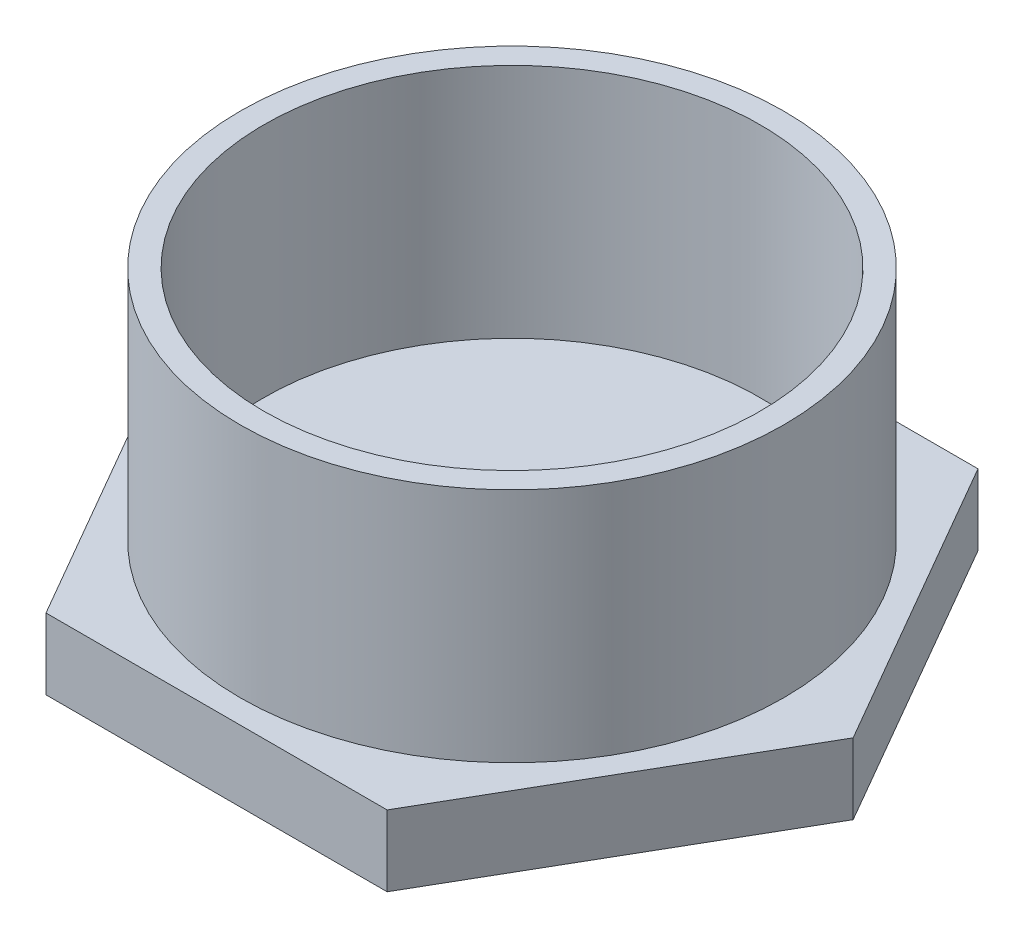
ISO-10303-21;
HEADER;
FILE_DESCRIPTION(('STEP AP214'),'2;1');
FILE_NAME('part.step','',(''),(''),'','','');
FILE_SCHEMA(('AUTOMOTIVE_DESIGN { 1 0 10303 214 1 1 1 1 }'));
ENDSEC;
DATA;
#1=APPLICATION_CONTEXT('core data for automotive mechanical design processes');
#2=APPLICATION_PROTOCOL_DEFINITION('international standard','automotive_design',2000,#1);
#3=PRODUCT_CONTEXT('',#1,'mechanical');
#4=PRODUCT('Part','Part','',(#3));
#5=PRODUCT_RELATED_PRODUCT_CATEGORY('part','',(#4));
#6=PRODUCT_DEFINITION_FORMATION('','',#4);
#7=PRODUCT_DEFINITION_CONTEXT('part definition',#1,'design');
#8=PRODUCT_DEFINITION('design','',#6,#7);
#9=PRODUCT_DEFINITION_SHAPE('','',#8);
#10=(LENGTH_UNIT() NAMED_UNIT(*) SI_UNIT(.MILLI.,.METRE.));
#11=(NAMED_UNIT(*) PLANE_ANGLE_UNIT() SI_UNIT($,.RADIAN.));
#12=(NAMED_UNIT(*) SI_UNIT($,.STERADIAN.) SOLID_ANGLE_UNIT());
#13=UNCERTAINTY_MEASURE_WITH_UNIT(LENGTH_MEASURE(1.E-05),#10,'distance_accuracy_value','');
#14=(GEOMETRIC_REPRESENTATION_CONTEXT(3) GLOBAL_UNCERTAINTY_ASSIGNED_CONTEXT((#13)) GLOBAL_UNIT_ASSIGNED_CONTEXT((#10,
#11,#12)) REPRESENTATION_CONTEXT('',''));
#15=CARTESIAN_POINT('',(0.,0.,0.));
#16=DIRECTION('',(0.,0.,1.));
#17=DIRECTION('',(1.,0.,0.));
#18=AXIS2_PLACEMENT_3D('',#15,#16,#17);
#19=CARTESIAN_POINT('',(-7.21687836487032,3.,12.5));
#20=DIRECTION('',(0.,0.,-1.));
#21=DIRECTION('',(-1.,0.,0.));
#22=AXIS2_PLACEMENT_3D('',#19,#20,#21);
#23=PLANE('',#22);
#24=DIRECTION('',(1.,0.,0.));
#25=VECTOR('',#24,1.);
#26=CARTESIAN_POINT('',(-7.21687836487032,0.,12.5));
#27=LINE('',#26,#25);
#28=CARTESIAN_POINT('',(-7.21687836487032,0.,12.5));
#29=VERTEX_POINT('',#28);
#30=CARTESIAN_POINT('',(7.21687836487032,0.,12.5));
#31=VERTEX_POINT('',#30);
#32=EDGE_CURVE('E119',#29,#31,#27,.T.);
#33=ORIENTED_EDGE('',*,*,#32,.T.);
#34=DIRECTION('',(0.,-1.,0.));
#35=VECTOR('',#34,1.);
#36=CARTESIAN_POINT('',(7.21687836487032,3.,12.5));
#37=LINE('',#36,#35);
#38=CARTESIAN_POINT('',(7.21687836487032,3.,12.5));
#39=VERTEX_POINT('',#38);
#40=EDGE_CURVE('E36',#39,#31,#37,.T.);
#41=ORIENTED_EDGE('',*,*,#40,.F.);
#42=DIRECTION('',(1.,0.,0.));
#43=VECTOR('',#42,1.);
#44=CARTESIAN_POINT('',(-7.21687836487032,3.,12.5));
#45=LINE('',#44,#43);
#46=CARTESIAN_POINT('',(-7.21687836487032,3.,12.5));
#47=VERTEX_POINT('',#46);
#48=EDGE_CURVE('E130',#47,#39,#45,.T.);
#49=ORIENTED_EDGE('',*,*,#48,.F.);
#50=DIRECTION('',(0.,-1.,0.));
#51=VECTOR('',#50,1.);
#52=CARTESIAN_POINT('',(-7.21687836487032,3.,12.5));
#53=LINE('',#52,#51);
#54=EDGE_CURVE('E115',#47,#29,#53,.T.);
#55=ORIENTED_EDGE('',*,*,#54,.T.);
#56=EDGE_LOOP('',(#33,#41,#49,#55));
#57=FACE_BOUND('',#56,.T.);
#58=ADVANCED_FACE('F33',(#57),#23,.F.);
#59=CARTESIAN_POINT('',(7.21687836487032,3.,12.5));
#60=DIRECTION('',(-0.866025403784439,0.,-0.5));
#61=DIRECTION('',(-0.5,0.,0.866025403784439));
#62=AXIS2_PLACEMENT_3D('',#59,#60,#61);
#63=PLANE('',#62);
#64=DIRECTION('',(0.5,0.,-0.866025403784439));
#65=VECTOR('',#64,1.);
#66=CARTESIAN_POINT('',(7.21687836487032,0.,12.5));
#67=LINE('',#66,#65);
#68=CARTESIAN_POINT('',(14.4337567297406,0.,0.));
#69=VERTEX_POINT('',#68);
#70=EDGE_CURVE('E122',#31,#69,#67,.T.);
#71=ORIENTED_EDGE('',*,*,#70,.T.);
#72=DIRECTION('',(0.,-1.,0.));
#73=VECTOR('',#72,1.);
#74=CARTESIAN_POINT('',(14.4337567297406,3.,0.));
#75=LINE('',#74,#73);
#76=CARTESIAN_POINT('',(14.4337567297406,3.,0.));
#77=VERTEX_POINT('',#76);
#78=EDGE_CURVE('E133',#77,#69,#75,.T.);
#79=ORIENTED_EDGE('',*,*,#78,.F.);
#80=DIRECTION('',(0.5,0.,-0.866025403784439));
#81=VECTOR('',#80,1.);
#82=CARTESIAN_POINT('',(7.21687836487032,3.,12.5));
#83=LINE('',#82,#81);
#84=EDGE_CURVE('E88',#39,#77,#83,.T.);
#85=ORIENTED_EDGE('',*,*,#84,.F.);
#86=ORIENTED_EDGE('',*,*,#40,.T.);
#87=EDGE_LOOP('',(#71,#79,#85,#86));
#88=FACE_BOUND('',#87,.T.);
#89=ADVANCED_FACE('F138',(#88),#63,.F.);
#90=CARTESIAN_POINT('',(14.4337567297406,3.,0.));
#91=DIRECTION('',(-0.866025403784439,0.,0.5));
#92=DIRECTION('',(0.5,0.,0.866025403784439));
#93=AXIS2_PLACEMENT_3D('',#90,#91,#92);
#94=PLANE('',#93);
#95=DIRECTION('',(-0.5,0.,-0.866025403784439));
#96=VECTOR('',#95,1.);
#97=CARTESIAN_POINT('',(14.4337567297406,0.,0.));
#98=LINE('',#97,#96);
#99=CARTESIAN_POINT('',(7.21687836487032,0.,-12.5));
#100=VERTEX_POINT('',#99);
#101=EDGE_CURVE('E125',#69,#100,#98,.T.);
#102=ORIENTED_EDGE('',*,*,#101,.T.);
#103=DIRECTION('',(0.,-1.,0.));
#104=VECTOR('',#103,1.);
#105=CARTESIAN_POINT('',(7.21687836487032,3.,-12.5));
#106=LINE('',#105,#104);
#107=CARTESIAN_POINT('',(7.21687836487032,3.,-12.5));
#108=VERTEX_POINT('',#107);
#109=EDGE_CURVE('E110',#108,#100,#106,.T.);
#110=ORIENTED_EDGE('',*,*,#109,.F.);
#111=DIRECTION('',(-0.5,0.,-0.866025403784439));
#112=VECTOR('',#111,1.);
#113=CARTESIAN_POINT('',(14.4337567297406,3.,0.));
#114=LINE('',#113,#112);
#115=EDGE_CURVE('E101',#77,#108,#114,.T.);
#116=ORIENTED_EDGE('',*,*,#115,.F.);
#117=ORIENTED_EDGE('',*,*,#78,.T.);
#118=EDGE_LOOP('',(#102,#110,#116,#117));
#119=FACE_BOUND('',#118,.T.);
#120=ADVANCED_FACE('F144',(#119),#94,.F.);
#121=CARTESIAN_POINT('',(7.21687836487032,3.,-12.5));
#122=DIRECTION('',(0.,0.,1.));
#123=DIRECTION('',(1.,0.,0.));
#124=AXIS2_PLACEMENT_3D('',#121,#122,#123);
#125=PLANE('',#124);
#126=DIRECTION('',(-1.,0.,0.));
#127=VECTOR('',#126,1.);
#128=CARTESIAN_POINT('',(7.21687836487032,0.,-12.5));
#129=LINE('',#128,#127);
#130=CARTESIAN_POINT('',(-7.21687836487033,0.,-12.5));
#131=VERTEX_POINT('',#130);
#132=EDGE_CURVE('E109',#100,#131,#129,.T.);
#133=ORIENTED_EDGE('',*,*,#132,.T.);
#134=DIRECTION('',(0.,-1.,0.));
#135=VECTOR('',#134,1.);
#136=CARTESIAN_POINT('',(-7.21687836487033,3.,-12.5));
#137=LINE('',#136,#135);
#138=CARTESIAN_POINT('',(-7.21687836487033,3.,-12.5));
#139=VERTEX_POINT('',#138);
#140=EDGE_CURVE('E106',#139,#131,#137,.T.);
#141=ORIENTED_EDGE('',*,*,#140,.F.);
#142=DIRECTION('',(-1.,0.,0.));
#143=VECTOR('',#142,1.);
#144=CARTESIAN_POINT('',(7.21687836487032,3.,-12.5));
#145=LINE('',#144,#143);
#146=EDGE_CURVE('E95',#108,#139,#145,.T.);
#147=ORIENTED_EDGE('',*,*,#146,.F.);
#148=ORIENTED_EDGE('',*,*,#109,.T.);
#149=EDGE_LOOP('',(#133,#141,#147,#148));
#150=FACE_BOUND('',#149,.T.);
#151=ADVANCED_FACE('F107',(#150),#125,.F.);
#152=CARTESIAN_POINT('',(-7.21687836487033,3.,-12.5));
#153=DIRECTION('',(0.866025403784439,0.,0.5));
#154=DIRECTION('',(0.5,0.,-0.866025403784439));
#155=AXIS2_PLACEMENT_3D('',#152,#153,#154);
#156=PLANE('',#155);
#157=DIRECTION('',(-0.5,0.,0.866025403784438));
#158=VECTOR('',#157,1.);
#159=CARTESIAN_POINT('',(-7.21687836487033,0.,-12.5));
#160=LINE('',#159,#158);
#161=CARTESIAN_POINT('',(-14.4337567297406,0.,0.));
#162=VERTEX_POINT('',#161);
#163=EDGE_CURVE('E73',#131,#162,#160,.T.);
#164=ORIENTED_EDGE('',*,*,#163,.T.);
#165=DIRECTION('',(0.,-1.,0.));
#166=VECTOR('',#165,1.);
#167=CARTESIAN_POINT('',(-14.4337567297406,3.,0.));
#168=LINE('',#167,#166);
#169=CARTESIAN_POINT('',(-14.4337567297406,3.,0.));
#170=VERTEX_POINT('',#169);
#171=EDGE_CURVE('E111',#170,#162,#168,.T.);
#172=ORIENTED_EDGE('',*,*,#171,.F.);
#173=DIRECTION('',(-0.5,0.,0.866025403784438));
#174=VECTOR('',#173,1.);
#175=CARTESIAN_POINT('',(-7.21687836487033,3.,-12.5));
#176=LINE('',#175,#174);
#177=EDGE_CURVE('E99',#139,#170,#176,.T.);
#178=ORIENTED_EDGE('',*,*,#177,.F.);
#179=ORIENTED_EDGE('',*,*,#140,.T.);
#180=EDGE_LOOP('',(#164,#172,#178,#179));
#181=FACE_BOUND('',#180,.T.);
#182=ADVANCED_FACE('F113',(#181),#156,.F.);
#183=CARTESIAN_POINT('',(-14.4337567297406,3.,0.));
#184=DIRECTION('',(0.866025403784439,0.,-0.5));
#185=DIRECTION('',(-0.5,0.,-0.866025403784439));
#186=AXIS2_PLACEMENT_3D('',#183,#184,#185);
#187=PLANE('',#186);
#188=DIRECTION('',(0.5,0.,0.866025403784439));
#189=VECTOR('',#188,1.);
#190=CARTESIAN_POINT('',(-14.4337567297406,0.,0.));
#191=LINE('',#190,#189);
#192=EDGE_CURVE('E79',#162,#29,#191,.T.);
#193=ORIENTED_EDGE('',*,*,#192,.T.);
#194=ORIENTED_EDGE('',*,*,#54,.F.);
#195=DIRECTION('',(0.5,0.,0.866025403784439));
#196=VECTOR('',#195,1.);
#197=CARTESIAN_POINT('',(-14.4337567297406,3.,0.));
#198=LINE('',#197,#196);
#199=EDGE_CURVE('E50',#170,#47,#198,.T.);
#200=ORIENTED_EDGE('',*,*,#199,.F.);
#201=ORIENTED_EDGE('',*,*,#171,.T.);
#202=EDGE_LOOP('',(#193,#194,#200,#201));
#203=FACE_BOUND('',#202,.T.);
#204=ADVANCED_FACE('F178',(#203),#187,.F.);
#205=CARTESIAN_POINT('',(0.,3.,0.));
#206=DIRECTION('',(0.,1.,0.));
#207=DIRECTION('',(0.,0.,1.));
#208=AXIS2_PLACEMENT_3D('',#205,#206,#207);
#209=PLANE('',#208);
#210=CARTESIAN_POINT('',(0.,3.,0.));
#211=DIRECTION('',(0.,1.,0.));
#212=DIRECTION('',(0.,0.,1.));
#213=AXIS2_PLACEMENT_3D('',#210,#211,#212);
#214=CIRCLE('',#213,11.5);
#215=CARTESIAN_POINT('',(0.,3.,11.5));
#216=VERTEX_POINT('',#215);
#217=EDGE_CURVE('E11',#216,#216,#214,.T.);
#218=ORIENTED_EDGE('',*,*,#217,.F.);
#219=EDGE_LOOP('',(#218));
#220=FACE_BOUND('',#219,.T.);
#221=ORIENTED_EDGE('',*,*,#48,.T.);
#222=ORIENTED_EDGE('',*,*,#84,.T.);
#223=ORIENTED_EDGE('',*,*,#115,.T.);
#224=ORIENTED_EDGE('',*,*,#146,.T.);
#225=ORIENTED_EDGE('',*,*,#177,.T.);
#226=ORIENTED_EDGE('',*,*,#199,.T.);
#227=EDGE_LOOP('',(#221,#222,#223,#224,#225,#226));
#228=FACE_BOUND('',#227,.T.);
#229=ADVANCED_FACE('F97',(#220,#228),#209,.T.);
#230=CARTESIAN_POINT('',(0.,0.,0.));
#231=DIRECTION('',(0.,1.,0.));
#232=DIRECTION('',(0.,0.,1.));
#233=AXIS2_PLACEMENT_3D('',#230,#231,#232);
#234=PLANE('',#233);
#235=ORIENTED_EDGE('',*,*,#32,.F.);
#236=ORIENTED_EDGE('',*,*,#192,.F.);
#237=ORIENTED_EDGE('',*,*,#163,.F.);
#238=ORIENTED_EDGE('',*,*,#132,.F.);
#239=ORIENTED_EDGE('',*,*,#101,.F.);
#240=ORIENTED_EDGE('',*,*,#70,.F.);
#241=EDGE_LOOP('',(#235,#236,#237,#238,#239,#240));
#242=FACE_BOUND('',#241,.T.);
#243=ADVANCED_FACE('F143',(#242),#234,.F.);
#244=CARTESIAN_POINT('',(0.,13.,0.));
#245=DIRECTION('',(0.,-1.,0.));
#246=DIRECTION('',(0.,0.,-1.));
#247=AXIS2_PLACEMENT_3D('',#244,#245,#246);
#248=CYLINDRICAL_SURFACE('',#247,11.5);
#249=CARTESIAN_POINT('',(0.,13.,0.));
#250=DIRECTION('',(0.,1.,0.));
#251=DIRECTION('',(0.,0.,1.));
#252=AXIS2_PLACEMENT_3D('',#249,#250,#251);
#253=CIRCLE('',#252,11.5);
#254=CARTESIAN_POINT('',(0.,13.,11.5));
#255=VERTEX_POINT('',#254);
#256=EDGE_CURVE('E123',#255,#255,#253,.T.);
#257=ORIENTED_EDGE('',*,*,#256,.F.);
#258=EDGE_LOOP('',(#257));
#259=FACE_BOUND('',#258,.T.);
#260=ORIENTED_EDGE('',*,*,#217,.T.);
#261=EDGE_LOOP('',(#260));
#262=FACE_BOUND('',#261,.T.);
#263=ADVANCED_FACE('F168',(#259,#262),#248,.T.);
#264=CARTESIAN_POINT('',(0.,13.,0.));
#265=DIRECTION('',(0.,1.,0.));
#266=DIRECTION('',(0.,0.,1.));
#267=AXIS2_PLACEMENT_3D('',#264,#265,#266);
#268=PLANE('',#267);
#269=CARTESIAN_POINT('',(0.,13.,0.));
#270=DIRECTION('',(0.,1.,0.));
#271=DIRECTION('',(0.,0.,1.));
#272=AXIS2_PLACEMENT_3D('',#269,#270,#271);
#273=CIRCLE('',#272,10.5);
#274=CARTESIAN_POINT('',(0.,13.,10.5));
#275=VERTEX_POINT('',#274);
#276=EDGE_CURVE('E151',#275,#275,#273,.T.);
#277=ORIENTED_EDGE('',*,*,#276,.F.);
#278=EDGE_LOOP('',(#277));
#279=FACE_BOUND('',#278,.T.);
#280=ORIENTED_EDGE('',*,*,#256,.T.);
#281=EDGE_LOOP('',(#280));
#282=FACE_BOUND('',#281,.T.);
#283=ADVANCED_FACE('F162',(#279,#282),#268,.T.);
#284=CARTESIAN_POINT('',(0.,3.,0.));
#285=DIRECTION('',(0.,1.,0.));
#286=DIRECTION('',(0.,0.,1.));
#287=AXIS2_PLACEMENT_3D('',#284,#285,#286);
#288=CYLINDRICAL_SURFACE('',#287,10.5);
#289=CARTESIAN_POINT('',(0.,3.,0.));
#290=DIRECTION('',(0.,1.,0.));
#291=DIRECTION('',(0.,0.,1.));
#292=AXIS2_PLACEMENT_3D('',#289,#290,#291);
#293=CIRCLE('',#292,10.5);
#294=CARTESIAN_POINT('',(0.,3.,10.5));
#295=VERTEX_POINT('',#294);
#296=EDGE_CURVE('E150',#295,#295,#293,.T.);
#297=ORIENTED_EDGE('',*,*,#296,.F.);
#298=EDGE_LOOP('',(#297));
#299=FACE_BOUND('',#298,.T.);
#300=ORIENTED_EDGE('',*,*,#276,.T.);
#301=EDGE_LOOP('',(#300));
#302=FACE_BOUND('',#301,.T.);
#303=ADVANCED_FACE('F159',(#299,#302),#288,.F.);
#304=CARTESIAN_POINT('',(0.,3.,0.));
#305=DIRECTION('',(0.,1.,0.));
#306=DIRECTION('',(0.,0.,1.));
#307=AXIS2_PLACEMENT_3D('',#304,#305,#306);
#308=PLANE('',#307);
#309=ORIENTED_EDGE('',*,*,#296,.T.);
#310=EDGE_LOOP('',(#309));
#311=FACE_BOUND('',#310,.T.);
#312=ADVANCED_FACE('F157',(#311),#308,.T.);
#313=CLOSED_SHELL('',(#58,#89,#120,#151,#182,#204,#229,#243,#263,#283,#303,#312));
#314=MANIFOLD_SOLID_BREP('B2',#313);
#315=ADVANCED_BREP_SHAPE_REPRESENTATION('',(#18,#314),#14);
#316=SHAPE_DEFINITION_REPRESENTATION(#9,#315);
ENDSEC;
END-ISO-10303-21;
